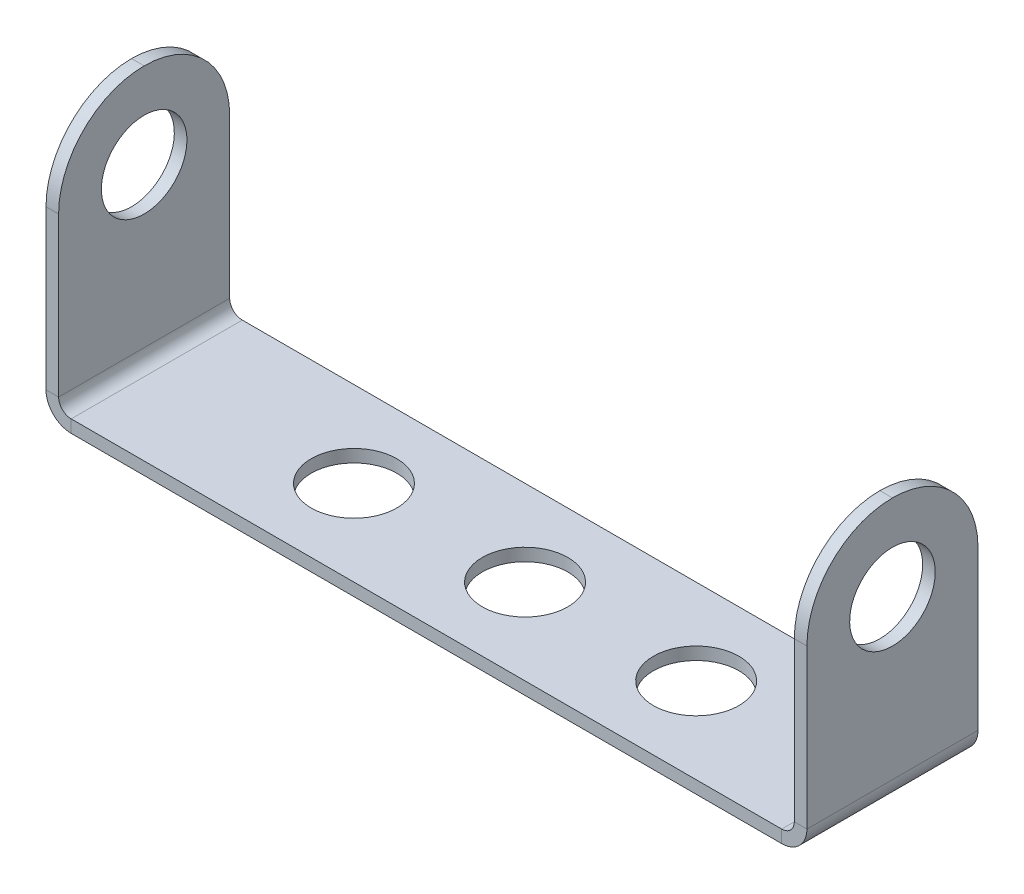
ISO-10303-21;
HEADER;
FILE_DESCRIPTION(('STEP AP214'),'2;1');
FILE_NAME('part.step','',(''),(''),'','','');
FILE_SCHEMA(('AUTOMOTIVE_DESIGN { 1 0 10303 214 1 1 1 1 }'));
ENDSEC;
DATA;
#1=APPLICATION_CONTEXT('core data for automotive mechanical design processes');
#2=APPLICATION_PROTOCOL_DEFINITION('international standard','automotive_design',2000,#1);
#3=PRODUCT_CONTEXT('',#1,'mechanical');
#4=PRODUCT('Part','Part','',(#3));
#5=PRODUCT_RELATED_PRODUCT_CATEGORY('part','',(#4));
#6=PRODUCT_DEFINITION_FORMATION('','',#4);
#7=PRODUCT_DEFINITION_CONTEXT('part definition',#1,'design');
#8=PRODUCT_DEFINITION('design','',#6,#7);
#9=PRODUCT_DEFINITION_SHAPE('','',#8);
#10=(LENGTH_UNIT() NAMED_UNIT(*) SI_UNIT(.MILLI.,.METRE.));
#11=(NAMED_UNIT(*) PLANE_ANGLE_UNIT() SI_UNIT($,.RADIAN.));
#12=(NAMED_UNIT(*) SI_UNIT($,.STERADIAN.) SOLID_ANGLE_UNIT());
#13=UNCERTAINTY_MEASURE_WITH_UNIT(LENGTH_MEASURE(1.E-05),#10,'distance_accuracy_value','');
#14=(GEOMETRIC_REPRESENTATION_CONTEXT(3) GLOBAL_UNCERTAINTY_ASSIGNED_CONTEXT((#13)) GLOBAL_UNIT_ASSIGNED_CONTEXT((#10,
#11,#12)) REPRESENTATION_CONTEXT('',''));
#15=CARTESIAN_POINT('',(0.,0.,0.));
#16=DIRECTION('',(0.,0.,1.));
#17=DIRECTION('',(1.,0.,0.));
#18=AXIS2_PLACEMENT_3D('',#15,#16,#17);
#19=CARTESIAN_POINT('',(-20.7634,0.,10.));
#20=DIRECTION('',(0.,0.,1.));
#21=DIRECTION('',(1.,0.,0.));
#22=AXIS2_PLACEMENT_3D('',#19,#20,#21);
#23=PLANE('',#22);
#24=DIRECTION('',(0.,-1.,0.));
#25=VECTOR('',#24,1.);
#26=CARTESIAN_POINT('',(-20.7634,0.,10.));
#27=LINE('',#26,#25);
#28=CARTESIAN_POINT('',(-20.7634,0.,10.));
#29=VERTEX_POINT('',#28);
#30=CARTESIAN_POINT('',(-20.7634,-0.7366,10.));
#31=VERTEX_POINT('',#30);
#32=EDGE_CURVE('E249',#29,#31,#27,.T.);
#33=ORIENTED_EDGE('',*,*,#32,.F.);
#34=CARTESIAN_POINT('',(-20.7634,0.7366,10.));
#35=DIRECTION('',(0.,0.,-1.));
#36=DIRECTION('',(-1.,0.,0.));
#37=AXIS2_PLACEMENT_3D('',#34,#35,#36);
#38=CIRCLE('',#37,0.7366);
#39=CARTESIAN_POINT('',(-21.5,0.7366,10.));
#40=VERTEX_POINT('',#39);
#41=EDGE_CURVE('E176',#40,#29,#38,.F.);
#42=ORIENTED_EDGE('',*,*,#41,.F.);
#43=DIRECTION('',(1.,0.,0.));
#44=VECTOR('',#43,1.);
#45=CARTESIAN_POINT('',(-22.2366,0.7366,10.));
#46=LINE('',#45,#44);
#47=CARTESIAN_POINT('',(-22.2366,0.7366,10.));
#48=VERTEX_POINT('',#47);
#49=EDGE_CURVE('E246',#48,#40,#46,.T.);
#50=ORIENTED_EDGE('',*,*,#49,.F.);
#51=CARTESIAN_POINT('',(-20.7634,0.7366,10.));
#52=DIRECTION('',(0.,0.,1.));
#53=DIRECTION('',(1.,0.,0.));
#54=AXIS2_PLACEMENT_3D('',#51,#52,#53);
#55=CIRCLE('',#54,1.4732);
#56=EDGE_CURVE('E186',#48,#31,#55,.T.);
#57=ORIENTED_EDGE('',*,*,#56,.T.);
#58=EDGE_LOOP('',(#33,#42,#50,#57));
#59=FACE_BOUND('',#58,.T.);
#60=ADVANCED_FACE('F39',(#59),#23,.T.);
#61=CARTESIAN_POINT('',(-22.2366,0.7366,10.));
#62=DIRECTION('',(0.,0.,1.));
#63=DIRECTION('',(1.,0.,0.));
#64=AXIS2_PLACEMENT_3D('',#61,#62,#63);
#65=PLANE('',#64);
#66=DIRECTION('',(1.,0.,0.));
#67=VECTOR('',#66,1.);
#68=CARTESIAN_POINT('',(-21.5,0.,10.));
#69=LINE('',#68,#67);
#70=CARTESIAN_POINT('',(20.7634,0.,10.));
#71=VERTEX_POINT('',#70);
#72=EDGE_CURVE('E174',#29,#71,#69,.T.);
#73=ORIENTED_EDGE('',*,*,#72,.F.);
#74=ORIENTED_EDGE('',*,*,#32,.T.);
#75=DIRECTION('',(1.,0.,0.));
#76=VECTOR('',#75,1.);
#77=CARTESIAN_POINT('',(-21.5,-0.7366,10.));
#78=LINE('',#77,#76);
#79=CARTESIAN_POINT('',(20.7634,-0.736599999999992,10.));
#80=VERTEX_POINT('',#79);
#81=EDGE_CURVE('E189',#31,#80,#78,.T.);
#82=ORIENTED_EDGE('',*,*,#81,.T.);
#83=DIRECTION('',(0.,1.,0.));
#84=VECTOR('',#83,1.);
#85=CARTESIAN_POINT('',(20.7634,-0.736599999999992,10.));
#86=LINE('',#85,#84);
#87=EDGE_CURVE('E152',#80,#71,#86,.T.);
#88=ORIENTED_EDGE('',*,*,#87,.T.);
#89=EDGE_LOOP('',(#73,#74,#82,#88));
#90=FACE_BOUND('',#89,.T.);
#91=ADVANCED_FACE('F329',(#90),#65,.T.);
#92=CARTESIAN_POINT('',(-21.5,0.7366,0.));
#93=DIRECTION('',(0.,0.,-1.));
#94=DIRECTION('',(-1.,0.,0.));
#95=AXIS2_PLACEMENT_3D('',#92,#93,#94);
#96=PLANE('',#95);
#97=DIRECTION('',(-1.,0.,0.));
#98=VECTOR('',#97,1.);
#99=CARTESIAN_POINT('',(-21.5,0.7366,0.));
#100=LINE('',#99,#98);
#101=CARTESIAN_POINT('',(-21.5,0.7366,0.));
#102=VERTEX_POINT('',#101);
#103=CARTESIAN_POINT('',(-22.2366,0.7366,0.));
#104=VERTEX_POINT('',#103);
#105=EDGE_CURVE('E243',#102,#104,#100,.T.);
#106=ORIENTED_EDGE('',*,*,#105,.F.);
#107=CARTESIAN_POINT('',(-20.7634,0.7366,0.));
#108=DIRECTION('',(0.,0.,-1.));
#109=DIRECTION('',(-1.,0.,0.));
#110=AXIS2_PLACEMENT_3D('',#107,#108,#109);
#111=CIRCLE('',#110,0.7366);
#112=CARTESIAN_POINT('',(-20.7634,0.,0.));
#113=VERTEX_POINT('',#112);
#114=EDGE_CURVE('E204',#102,#113,#111,.F.);
#115=ORIENTED_EDGE('',*,*,#114,.T.);
#116=DIRECTION('',(0.,1.,0.));
#117=VECTOR('',#116,1.);
#118=CARTESIAN_POINT('',(-20.7634,-0.7366,0.));
#119=LINE('',#118,#117);
#120=CARTESIAN_POINT('',(-20.7634,-0.7366,0.));
#121=VERTEX_POINT('',#120);
#122=EDGE_CURVE('E151',#121,#113,#119,.T.);
#123=ORIENTED_EDGE('',*,*,#122,.F.);
#124=CARTESIAN_POINT('',(-20.7634,0.7366,0.));
#125=DIRECTION('',(0.,0.,1.));
#126=DIRECTION('',(1.,0.,0.));
#127=AXIS2_PLACEMENT_3D('',#124,#125,#126);
#128=CIRCLE('',#127,1.4732);
#129=EDGE_CURVE('E211',#104,#121,#128,.T.);
#130=ORIENTED_EDGE('',*,*,#129,.F.);
#131=EDGE_LOOP('',(#106,#115,#123,#130));
#132=FACE_BOUND('',#131,.T.);
#133=ADVANCED_FACE('F344',(#132),#96,.T.);
#134=CARTESIAN_POINT('',(-20.7634,-0.7366,0.));
#135=DIRECTION('',(0.,0.,-1.));
#136=DIRECTION('',(-1.,0.,0.));
#137=AXIS2_PLACEMENT_3D('',#134,#135,#136);
#138=PLANE('',#137);
#139=DIRECTION('',(0.,-1.,0.));
#140=VECTOR('',#139,1.);
#141=CARTESIAN_POINT('',(-22.2366,15.,0.));
#142=LINE('',#141,#140);
#143=CARTESIAN_POINT('',(-22.2366,10.,0.));
#144=VERTEX_POINT('',#143);
#145=EDGE_CURVE('E209',#144,#104,#142,.T.);
#146=ORIENTED_EDGE('',*,*,#145,.F.);
#147=DIRECTION('',(1.,0.,0.));
#148=VECTOR('',#147,1.);
#149=CARTESIAN_POINT('',(-20.7634,10.,0.));
#150=LINE('',#149,#148);
#151=CARTESIAN_POINT('',(-21.5,10.,0.));
#152=VERTEX_POINT('',#151);
#153=EDGE_CURVE('E251',#144,#152,#150,.T.);
#154=ORIENTED_EDGE('',*,*,#153,.T.);
#155=DIRECTION('',(0.,-1.,0.));
#156=VECTOR('',#155,1.);
#157=CARTESIAN_POINT('',(-21.5,15.,0.));
#158=LINE('',#157,#156);
#159=EDGE_CURVE('E207',#152,#102,#158,.T.);
#160=ORIENTED_EDGE('',*,*,#159,.T.);
#161=ORIENTED_EDGE('',*,*,#105,.T.);
#162=EDGE_LOOP('',(#146,#154,#160,#161));
#163=FACE_BOUND('',#162,.T.);
#164=ADVANCED_FACE('F363',(#163),#138,.T.);
#165=CARTESIAN_POINT('',(21.5,0.736600000000008,10.));
#166=DIRECTION('',(0.,0.,1.));
#167=DIRECTION('',(1.,0.,0.));
#168=AXIS2_PLACEMENT_3D('',#165,#166,#167);
#169=PLANE('',#168);
#170=DIRECTION('',(1.,0.,0.));
#171=VECTOR('',#170,1.);
#172=CARTESIAN_POINT('',(21.5,0.736600000000008,10.));
#173=LINE('',#172,#171);
#174=CARTESIAN_POINT('',(21.5,0.736600000000008,10.));
#175=VERTEX_POINT('',#174);
#176=CARTESIAN_POINT('',(22.2366,0.736600000000008,10.));
#177=VERTEX_POINT('',#176);
#178=EDGE_CURVE('E139',#175,#177,#173,.T.);
#179=ORIENTED_EDGE('',*,*,#178,.F.);
#180=CARTESIAN_POINT('',(20.7634,0.736600000000008,10.));
#181=DIRECTION('',(0.,0.,-1.));
#182=DIRECTION('',(-1.,0.,0.));
#183=AXIS2_PLACEMENT_3D('',#180,#181,#182);
#184=CIRCLE('',#183,0.7366);
#185=EDGE_CURVE('E143',#71,#175,#184,.F.);
#186=ORIENTED_EDGE('',*,*,#185,.F.);
#187=ORIENTED_EDGE('',*,*,#87,.F.);
#188=CARTESIAN_POINT('',(20.7634,0.736600000000008,10.));
#189=DIRECTION('',(0.,0.,1.));
#190=DIRECTION('',(1.,0.,0.));
#191=AXIS2_PLACEMENT_3D('',#188,#189,#190);
#192=CIRCLE('',#191,1.4732);
#193=EDGE_CURVE('E146',#80,#177,#192,.T.);
#194=ORIENTED_EDGE('',*,*,#193,.T.);
#195=EDGE_LOOP('',(#179,#186,#187,#194));
#196=FACE_BOUND('',#195,.T.);
#197=ADVANCED_FACE('F141',(#196),#169,.T.);
#198=CARTESIAN_POINT('',(20.7634,-0.736599999999992,10.));
#199=DIRECTION('',(0.,0.,1.));
#200=DIRECTION('',(1.,0.,0.));
#201=AXIS2_PLACEMENT_3D('',#198,#199,#200);
#202=PLANE('',#201);
#203=DIRECTION('',(0.,1.,0.));
#204=VECTOR('',#203,1.);
#205=CARTESIAN_POINT('',(22.2366,0.,10.));
#206=LINE('',#205,#204);
#207=CARTESIAN_POINT('',(22.2366,10.,10.));
#208=VERTEX_POINT('',#207);
#209=EDGE_CURVE('E169',#177,#208,#206,.T.);
#210=ORIENTED_EDGE('',*,*,#209,.T.);
#211=DIRECTION('',(1.,0.,0.));
#212=VECTOR('',#211,1.);
#213=CARTESIAN_POINT('',(20.7634,10.,10.));
#214=LINE('',#213,#212);
#215=CARTESIAN_POINT('',(21.5,10.,10.));
#216=VERTEX_POINT('',#215);
#217=EDGE_CURVE('E168',#208,#216,#214,.F.);
#218=ORIENTED_EDGE('',*,*,#217,.T.);
#219=DIRECTION('',(0.,1.,0.));
#220=VECTOR('',#219,1.);
#221=CARTESIAN_POINT('',(21.5,0.,10.));
#222=LINE('',#221,#220);
#223=EDGE_CURVE('E157',#175,#216,#222,.T.);
#224=ORIENTED_EDGE('',*,*,#223,.F.);
#225=ORIENTED_EDGE('',*,*,#178,.T.);
#226=EDGE_LOOP('',(#210,#218,#224,#225));
#227=FACE_BOUND('',#226,.T.);
#228=ADVANCED_FACE('F166',(#227),#202,.T.);
#229=CARTESIAN_POINT('',(20.7634,0.,0.));
#230=DIRECTION('',(0.,0.,-1.));
#231=DIRECTION('',(-1.,0.,0.));
#232=AXIS2_PLACEMENT_3D('',#229,#230,#231);
#233=PLANE('',#232);
#234=DIRECTION('',(0.,-1.,0.));
#235=VECTOR('',#234,1.);
#236=CARTESIAN_POINT('',(20.7634,0.,0.));
#237=LINE('',#236,#235);
#238=CARTESIAN_POINT('',(20.7634,0.,0.));
#239=VERTEX_POINT('',#238);
#240=CARTESIAN_POINT('',(20.7634,-0.736599999999992,0.));
#241=VERTEX_POINT('',#240);
#242=EDGE_CURVE('E239',#239,#241,#237,.T.);
#243=ORIENTED_EDGE('',*,*,#242,.F.);
#244=CARTESIAN_POINT('',(20.7634,0.736600000000008,0.));
#245=DIRECTION('',(0.,0.,-1.));
#246=DIRECTION('',(-1.,0.,0.));
#247=AXIS2_PLACEMENT_3D('',#244,#245,#246);
#248=CIRCLE('',#247,0.7366);
#249=CARTESIAN_POINT('',(21.5,0.736600000000008,0.));
#250=VERTEX_POINT('',#249);
#251=EDGE_CURVE('E199',#239,#250,#248,.F.);
#252=ORIENTED_EDGE('',*,*,#251,.T.);
#253=DIRECTION('',(-1.,0.,0.));
#254=VECTOR('',#253,1.);
#255=CARTESIAN_POINT('',(22.2366,0.736600000000008,0.));
#256=LINE('',#255,#254);
#257=CARTESIAN_POINT('',(22.2366,0.736600000000008,0.));
#258=VERTEX_POINT('',#257);
#259=EDGE_CURVE('E162',#258,#250,#256,.T.);
#260=ORIENTED_EDGE('',*,*,#259,.F.);
#261=CARTESIAN_POINT('',(20.7634,0.736600000000008,0.));
#262=DIRECTION('',(0.,0.,1.));
#263=DIRECTION('',(1.,0.,0.));
#264=AXIS2_PLACEMENT_3D('',#261,#262,#263);
#265=CIRCLE('',#264,1.4732);
#266=EDGE_CURVE('E217',#241,#258,#265,.T.);
#267=ORIENTED_EDGE('',*,*,#266,.F.);
#268=EDGE_LOOP('',(#243,#252,#260,#267));
#269=FACE_BOUND('',#268,.T.);
#270=ADVANCED_FACE('F312',(#269),#233,.T.);
#271=CARTESIAN_POINT('',(22.2366,0.736600000000008,0.));
#272=DIRECTION('',(0.,0.,-1.));
#273=DIRECTION('',(-1.,0.,0.));
#274=AXIS2_PLACEMENT_3D('',#271,#272,#273);
#275=PLANE('',#274);
#276=DIRECTION('',(1.,0.,0.));
#277=VECTOR('',#276,1.);
#278=CARTESIAN_POINT('',(-21.5,0.,0.));
#279=LINE('',#278,#277);
#280=EDGE_CURVE('E201',#113,#239,#279,.T.);
#281=ORIENTED_EDGE('',*,*,#280,.T.);
#282=ORIENTED_EDGE('',*,*,#242,.T.);
#283=DIRECTION('',(1.,0.,0.));
#284=VECTOR('',#283,1.);
#285=CARTESIAN_POINT('',(-21.5,-0.7366,0.));
#286=LINE('',#285,#284);
#287=EDGE_CURVE('E214',#121,#241,#286,.T.);
#288=ORIENTED_EDGE('',*,*,#287,.F.);
#289=ORIENTED_EDGE('',*,*,#122,.T.);
#290=EDGE_LOOP('',(#281,#282,#288,#289));
#291=FACE_BOUND('',#290,.T.);
#292=ADVANCED_FACE('F322',(#291),#275,.T.);
#293=CARTESIAN_POINT('',(22.2366,0.,10.));
#294=DIRECTION('',(-1.,0.,0.));
#295=DIRECTION('',(0.,-1.,0.));
#296=AXIS2_PLACEMENT_3D('',#293,#294,#295);
#297=PLANE('',#296);
#298=CARTESIAN_POINT('',(22.2366,10.,5.));
#299=DIRECTION('',(1.,0.,0.));
#300=DIRECTION('',(0.,1.,0.));
#301=AXIS2_PLACEMENT_3D('',#298,#299,#300);
#302=CIRCLE('',#301,2.5);
#303=CARTESIAN_POINT('',(22.2366,12.5,5.));
#304=VERTEX_POINT('',#303);
#305=EDGE_CURVE('E272',#304,#304,#302,.T.);
#306=ORIENTED_EDGE('',*,*,#305,.F.);
#307=EDGE_LOOP('',(#306));
#308=FACE_BOUND('',#307,.T.);
#309=CARTESIAN_POINT('',(22.2366,10.,5.));
#310=DIRECTION('',(-1.,0.,0.));
#311=DIRECTION('',(0.,-1.,0.));
#312=AXIS2_PLACEMENT_3D('',#309,#310,#311);
#313=CIRCLE('',#312,5.);
#314=CARTESIAN_POINT('',(22.2366,10.,0.));
#315=VERTEX_POINT('',#314);
#316=CARTESIAN_POINT('',(22.2366,15.,5.));
#317=VERTEX_POINT('',#316);
#318=EDGE_CURVE('E264',#315,#317,#313,.F.);
#319=ORIENTED_EDGE('',*,*,#318,.T.);
#320=CARTESIAN_POINT('',(22.2366,10.,5.));
#321=DIRECTION('',(-1.,0.,0.));
#322=DIRECTION('',(0.,-1.,0.));
#323=AXIS2_PLACEMENT_3D('',#320,#321,#322);
#324=CIRCLE('',#323,5.);
#325=EDGE_CURVE('E266',#317,#208,#324,.F.);
#326=ORIENTED_EDGE('',*,*,#325,.T.);
#327=ORIENTED_EDGE('',*,*,#209,.F.);
#328=DIRECTION('',(0.,0.,-1.));
#329=VECTOR('',#328,1.);
#330=CARTESIAN_POINT('',(22.2366,0.736600000000008,10.));
#331=LINE('',#330,#329);
#332=EDGE_CURVE('E193',#177,#258,#331,.T.);
#333=ORIENTED_EDGE('',*,*,#332,.T.);
#334=DIRECTION('',(0.,1.,0.));
#335=VECTOR('',#334,1.);
#336=CARTESIAN_POINT('',(22.2366,0.,0.));
#337=LINE('',#336,#335);
#338=EDGE_CURVE('E194',#258,#315,#337,.T.);
#339=ORIENTED_EDGE('',*,*,#338,.T.);
#340=EDGE_LOOP('',(#319,#326,#327,#333,#339));
#341=FACE_BOUND('',#340,.T.);
#342=ADVANCED_FACE('F303',(#308,#341),#297,.F.);
#343=CARTESIAN_POINT('',(21.5,0.,10.));
#344=DIRECTION('',(-1.,0.,0.));
#345=DIRECTION('',(0.,-1.,0.));
#346=AXIS2_PLACEMENT_3D('',#343,#344,#345);
#347=PLANE('',#346);
#348=CARTESIAN_POINT('',(21.5,10.,5.));
#349=DIRECTION('',(-1.,0.,0.));
#350=DIRECTION('',(0.,-1.,0.));
#351=AXIS2_PLACEMENT_3D('',#348,#349,#350);
#352=CIRCLE('',#351,2.5);
#353=CARTESIAN_POINT('',(21.5,7.50000000000001,5.));
#354=VERTEX_POINT('',#353);
#355=EDGE_CURVE('E197',#354,#354,#352,.T.);
#356=ORIENTED_EDGE('',*,*,#355,.F.);
#357=EDGE_LOOP('',(#356));
#358=FACE_BOUND('',#357,.T.);
#359=ORIENTED_EDGE('',*,*,#223,.T.);
#360=CARTESIAN_POINT('',(21.5,10.,5.));
#361=DIRECTION('',(-1.,0.,0.));
#362=DIRECTION('',(0.,-1.,0.));
#363=AXIS2_PLACEMENT_3D('',#360,#361,#362);
#364=CIRCLE('',#363,5.);
#365=CARTESIAN_POINT('',(21.5,15.,5.));
#366=VERTEX_POINT('',#365);
#367=EDGE_CURVE('E48',#216,#366,#364,.T.);
#368=ORIENTED_EDGE('',*,*,#367,.T.);
#369=CARTESIAN_POINT('',(21.5,10.,5.));
#370=DIRECTION('',(-1.,0.,0.));
#371=DIRECTION('',(0.,-1.,0.));
#372=AXIS2_PLACEMENT_3D('',#369,#370,#371);
#373=CIRCLE('',#372,5.);
#374=CARTESIAN_POINT('',(21.5,10.,0.));
#375=VERTEX_POINT('',#374);
#376=EDGE_CURVE('E59',#366,#375,#373,.T.);
#377=ORIENTED_EDGE('',*,*,#376,.T.);
#378=DIRECTION('',(0.,1.,0.));
#379=VECTOR('',#378,1.);
#380=CARTESIAN_POINT('',(21.5,0.,0.));
#381=LINE('',#380,#379);
#382=EDGE_CURVE('E158',#250,#375,#381,.T.);
#383=ORIENTED_EDGE('',*,*,#382,.F.);
#384=DIRECTION('',(0.,0.,-1.));
#385=VECTOR('',#384,1.);
#386=CARTESIAN_POINT('',(21.5,0.736600000000008,10.));
#387=LINE('',#386,#385);
#388=EDGE_CURVE('E155',#175,#250,#387,.T.);
#389=ORIENTED_EDGE('',*,*,#388,.F.);
#390=EDGE_LOOP('',(#359,#368,#377,#383,#389));
#391=FACE_BOUND('',#390,.T.);
#392=ADVANCED_FACE('F156',(#358,#391),#347,.T.);
#393=CARTESIAN_POINT('',(20.7634,0.736600000000008,10.));
#394=DIRECTION('',(0.,0.,-1.));
#395=DIRECTION('',(-1.,0.,0.));
#396=AXIS2_PLACEMENT_3D('',#393,#394,#395);
#397=CYLINDRICAL_SURFACE('',#396,0.7366);
#398=ORIENTED_EDGE('',*,*,#251,.F.);
#399=DIRECTION('',(0.,0.,-1.));
#400=VECTOR('',#399,1.);
#401=CARTESIAN_POINT('',(20.7634,0.,10.));
#402=LINE('',#401,#400);
#403=EDGE_CURVE('E163',#71,#239,#402,.T.);
#404=ORIENTED_EDGE('',*,*,#403,.F.);
#405=ORIENTED_EDGE('',*,*,#185,.T.);
#406=ORIENTED_EDGE('',*,*,#388,.T.);
#407=EDGE_LOOP('',(#398,#404,#405,#406));
#408=FACE_BOUND('',#407,.T.);
#409=ADVANCED_FACE('F172',(#408),#397,.F.);
#410=CARTESIAN_POINT('',(-21.5,0.,10.));
#411=DIRECTION('',(0.,1.,0.));
#412=DIRECTION('',(-1.,0.,0.));
#413=AXIS2_PLACEMENT_3D('',#410,#411,#412);
#414=PLANE('',#413);
#415=CARTESIAN_POINT('',(-9.23660000000001,0.,5.00000000000014));
#416=DIRECTION('',(0.,1.,0.));
#417=DIRECTION('',(-1.,0.,0.));
#418=AXIS2_PLACEMENT_3D('',#415,#416,#417);
#419=CIRCLE('',#418,2.5);
#420=CARTESIAN_POINT('',(-11.7366,0.,5.00000000000014));
#421=VERTEX_POINT('',#420);
#422=EDGE_CURVE('E590',#421,#421,#419,.T.);
#423=ORIENTED_EDGE('',*,*,#422,.F.);
#424=EDGE_LOOP('',(#423));
#425=FACE_BOUND('',#424,.T.);
#426=CARTESIAN_POINT('',(0.763399999999994,0.,5.00000000000007));
#427=DIRECTION('',(0.,1.,0.));
#428=DIRECTION('',(-1.,0.,0.));
#429=AXIS2_PLACEMENT_3D('',#426,#427,#428);
#430=CIRCLE('',#429,2.5);
#431=CARTESIAN_POINT('',(-1.7366,0.,5.00000000000007));
#432=VERTEX_POINT('',#431);
#433=EDGE_CURVE('E594',#432,#432,#430,.T.);
#434=ORIENTED_EDGE('',*,*,#433,.F.);
#435=EDGE_LOOP('',(#434));
#436=FACE_BOUND('',#435,.T.);
#437=CARTESIAN_POINT('',(10.7634,0.,5.));
#438=DIRECTION('',(0.,1.,0.));
#439=DIRECTION('',(-1.,0.,0.));
#440=AXIS2_PLACEMENT_3D('',#437,#438,#439);
#441=CIRCLE('',#440,2.5);
#442=CARTESIAN_POINT('',(8.2634,0.,5.));
#443=VERTEX_POINT('',#442);
#444=EDGE_CURVE('E285',#443,#443,#441,.T.);
#445=ORIENTED_EDGE('',*,*,#444,.F.);
#446=EDGE_LOOP('',(#445));
#447=FACE_BOUND('',#446,.T.);
#448=ORIENTED_EDGE('',*,*,#280,.F.);
#449=DIRECTION('',(0.,0.,-1.));
#450=VECTOR('',#449,1.);
#451=CARTESIAN_POINT('',(-20.7634,0.,10.));
#452=LINE('',#451,#450);
#453=EDGE_CURVE('E234',#29,#113,#452,.T.);
#454=ORIENTED_EDGE('',*,*,#453,.F.);
#455=ORIENTED_EDGE('',*,*,#72,.T.);
#456=ORIENTED_EDGE('',*,*,#403,.T.);
#457=EDGE_LOOP('',(#448,#454,#455,#456));
#458=FACE_BOUND('',#457,.T.);
#459=ADVANCED_FACE('F325',(#425,#436,#447,#458),#414,.T.);
#460=CARTESIAN_POINT('',(-20.7634,0.7366,10.));
#461=DIRECTION('',(0.,0.,-1.));
#462=DIRECTION('',(-1.,0.,0.));
#463=AXIS2_PLACEMENT_3D('',#460,#461,#462);
#464=CYLINDRICAL_SURFACE('',#463,0.7366);
#465=ORIENTED_EDGE('',*,*,#114,.F.);
#466=DIRECTION('',(0.,0.,-1.));
#467=VECTOR('',#466,1.);
#468=CARTESIAN_POINT('',(-21.5,0.7366,10.));
#469=LINE('',#468,#467);
#470=EDGE_CURVE('E231',#40,#102,#469,.T.);
#471=ORIENTED_EDGE('',*,*,#470,.F.);
#472=ORIENTED_EDGE('',*,*,#41,.T.);
#473=ORIENTED_EDGE('',*,*,#453,.T.);
#474=EDGE_LOOP('',(#465,#471,#472,#473));
#475=FACE_BOUND('',#474,.T.);
#476=ADVANCED_FACE('F334',(#475),#464,.F.);
#477=CARTESIAN_POINT('',(-21.5,15.,10.));
#478=DIRECTION('',(1.,0.,0.));
#479=DIRECTION('',(0.,1.,0.));
#480=AXIS2_PLACEMENT_3D('',#477,#478,#479);
#481=PLANE('',#480);
#482=CARTESIAN_POINT('',(-21.5,10.,5.));
#483=DIRECTION('',(1.,0.,0.));
#484=DIRECTION('',(0.,1.,0.));
#485=AXIS2_PLACEMENT_3D('',#482,#483,#484);
#486=CIRCLE('',#485,2.5);
#487=CARTESIAN_POINT('',(-21.5,12.5,5.));
#488=VERTEX_POINT('',#487);
#489=EDGE_CURVE('E295',#488,#488,#486,.T.);
#490=ORIENTED_EDGE('',*,*,#489,.F.);
#491=EDGE_LOOP('',(#490));
#492=FACE_BOUND('',#491,.T.);
#493=ORIENTED_EDGE('',*,*,#159,.F.);
#494=CARTESIAN_POINT('',(-21.5,10.,5.));
#495=DIRECTION('',(1.,0.,0.));
#496=DIRECTION('',(0.,1.,0.));
#497=AXIS2_PLACEMENT_3D('',#494,#495,#496);
#498=CIRCLE('',#497,5.);
#499=CARTESIAN_POINT('',(-21.5,15.,5.));
#500=VERTEX_POINT('',#499);
#501=EDGE_CURVE('E256',#152,#500,#498,.T.);
#502=ORIENTED_EDGE('',*,*,#501,.T.);
#503=CARTESIAN_POINT('',(-21.5,10.,5.));
#504=DIRECTION('',(1.,0.,0.));
#505=DIRECTION('',(0.,1.,0.));
#506=AXIS2_PLACEMENT_3D('',#503,#504,#505);
#507=CIRCLE('',#506,5.);
#508=CARTESIAN_POINT('',(-21.5,10.,10.));
#509=VERTEX_POINT('',#508);
#510=EDGE_CURVE('E254',#500,#509,#507,.T.);
#511=ORIENTED_EDGE('',*,*,#510,.T.);
#512=DIRECTION('',(0.,-1.,0.));
#513=VECTOR('',#512,1.);
#514=CARTESIAN_POINT('',(-21.5,15.,10.));
#515=LINE('',#514,#513);
#516=EDGE_CURVE('E182',#509,#40,#515,.T.);
#517=ORIENTED_EDGE('',*,*,#516,.T.);
#518=ORIENTED_EDGE('',*,*,#470,.T.);
#519=EDGE_LOOP('',(#493,#502,#511,#517,#518));
#520=FACE_BOUND('',#519,.T.);
#521=ADVANCED_FACE('F349',(#492,#520),#481,.T.);
#522=CARTESIAN_POINT('',(-22.2366,15.,10.));
#523=DIRECTION('',(1.,0.,0.));
#524=DIRECTION('',(0.,1.,0.));
#525=AXIS2_PLACEMENT_3D('',#522,#523,#524);
#526=PLANE('',#525);
#527=CARTESIAN_POINT('',(-22.2366,10.,5.));
#528=DIRECTION('',(1.,0.,0.));
#529=DIRECTION('',(0.,1.,0.));
#530=AXIS2_PLACEMENT_3D('',#527,#528,#529);
#531=CIRCLE('',#530,2.5);
#532=CARTESIAN_POINT('',(-22.2366,12.5,5.));
#533=VERTEX_POINT('',#532);
#534=EDGE_CURVE('E277',#533,#533,#531,.T.);
#535=ORIENTED_EDGE('',*,*,#534,.T.);
#536=EDGE_LOOP('',(#535));
#537=FACE_BOUND('',#536,.T.);
#538=CARTESIAN_POINT('',(-22.2366,10.,5.));
#539=DIRECTION('',(1.,0.,0.));
#540=DIRECTION('',(0.,1.,0.));
#541=AXIS2_PLACEMENT_3D('',#538,#539,#540);
#542=CIRCLE('',#541,5.);
#543=CARTESIAN_POINT('',(-22.2366,10.,10.));
#544=VERTEX_POINT('',#543);
#545=CARTESIAN_POINT('',(-22.2366,15.,5.));
#546=VERTEX_POINT('',#545);
#547=EDGE_CURVE('E258',#544,#546,#542,.F.);
#548=ORIENTED_EDGE('',*,*,#547,.T.);
#549=CARTESIAN_POINT('',(-22.2366,10.,5.));
#550=DIRECTION('',(1.,0.,0.));
#551=DIRECTION('',(0.,1.,0.));
#552=AXIS2_PLACEMENT_3D('',#549,#550,#551);
#553=CIRCLE('',#552,5.);
#554=EDGE_CURVE('E260',#546,#144,#553,.F.);
#555=ORIENTED_EDGE('',*,*,#554,.T.);
#556=ORIENTED_EDGE('',*,*,#145,.T.);
#557=DIRECTION('',(0.,0.,-1.));
#558=VECTOR('',#557,1.);
#559=CARTESIAN_POINT('',(-22.2366,0.7366,10.));
#560=LINE('',#559,#558);
#561=EDGE_CURVE('E228',#48,#104,#560,.T.);
#562=ORIENTED_EDGE('',*,*,#561,.F.);
#563=DIRECTION('',(0.,-1.,0.));
#564=VECTOR('',#563,1.);
#565=CARTESIAN_POINT('',(-22.2366,15.,10.));
#566=LINE('',#565,#564);
#567=EDGE_CURVE('E184',#544,#48,#566,.T.);
#568=ORIENTED_EDGE('',*,*,#567,.F.);
#569=EDGE_LOOP('',(#548,#555,#556,#562,#568));
#570=FACE_BOUND('',#569,.T.);
#571=ADVANCED_FACE('F358',(#537,#570),#526,.F.);
#572=CARTESIAN_POINT('',(-20.7634,0.7366,10.));
#573=DIRECTION('',(0.,0.,-1.));
#574=DIRECTION('',(-1.,0.,0.));
#575=AXIS2_PLACEMENT_3D('',#572,#573,#574);
#576=CYLINDRICAL_SURFACE('',#575,1.4732);
#577=ORIENTED_EDGE('',*,*,#129,.T.);
#578=DIRECTION('',(0.,0.,-1.));
#579=VECTOR('',#578,1.);
#580=CARTESIAN_POINT('',(-20.7634,-0.7366,10.));
#581=LINE('',#580,#579);
#582=EDGE_CURVE('E225',#31,#121,#581,.T.);
#583=ORIENTED_EDGE('',*,*,#582,.F.);
#584=ORIENTED_EDGE('',*,*,#56,.F.);
#585=ORIENTED_EDGE('',*,*,#561,.T.);
#586=EDGE_LOOP('',(#577,#583,#584,#585));
#587=FACE_BOUND('',#586,.T.);
#588=ADVANCED_FACE('F340',(#587),#576,.T.);
#589=CARTESIAN_POINT('',(-21.5,-0.7366,10.));
#590=DIRECTION('',(0.,1.,0.));
#591=DIRECTION('',(-1.,0.,0.));
#592=AXIS2_PLACEMENT_3D('',#589,#590,#591);
#593=PLANE('',#592);
#594=CARTESIAN_POINT('',(-9.23660000000001,-0.736599999999998,5.00000000000014));
#595=DIRECTION('',(0.,1.,0.));
#596=DIRECTION('',(-1.,0.,0.));
#597=AXIS2_PLACEMENT_3D('',#594,#595,#596);
#598=CIRCLE('',#597,2.5);
#599=CARTESIAN_POINT('',(-11.7366,-0.736599999999998,5.00000000000014));
#600=VERTEX_POINT('',#599);
#601=EDGE_CURVE('E593',#600,#600,#598,.F.);
#602=ORIENTED_EDGE('',*,*,#601,.F.);
#603=EDGE_LOOP('',(#602));
#604=FACE_BOUND('',#603,.T.);
#605=CARTESIAN_POINT('',(0.763399999999994,-0.736599999999996,5.00000000000007));
#606=DIRECTION('',(0.,1.,0.));
#607=DIRECTION('',(-1.,0.,0.));
#608=AXIS2_PLACEMENT_3D('',#605,#606,#607);
#609=CIRCLE('',#608,2.5);
#610=CARTESIAN_POINT('',(-1.7366,-0.736599999999996,5.00000000000007));
#611=VERTEX_POINT('',#610);
#612=EDGE_CURVE('E290',#611,#611,#609,.F.);
#613=ORIENTED_EDGE('',*,*,#612,.F.);
#614=EDGE_LOOP('',(#613));
#615=FACE_BOUND('',#614,.T.);
#616=CARTESIAN_POINT('',(10.7634,-0.736599999999994,5.));
#617=DIRECTION('',(0.,1.,0.));
#618=DIRECTION('',(-1.,0.,0.));
#619=AXIS2_PLACEMENT_3D('',#616,#617,#618);
#620=CIRCLE('',#619,2.5);
#621=CARTESIAN_POINT('',(8.2634,-0.736599999999994,5.));
#622=VERTEX_POINT('',#621);
#623=EDGE_CURVE('E280',#622,#622,#620,.F.);
#624=ORIENTED_EDGE('',*,*,#623,.F.);
#625=EDGE_LOOP('',(#624));
#626=FACE_BOUND('',#625,.T.);
#627=ORIENTED_EDGE('',*,*,#287,.T.);
#628=DIRECTION('',(0.,0.,-1.));
#629=VECTOR('',#628,1.);
#630=CARTESIAN_POINT('',(20.7634,-0.736599999999992,10.));
#631=LINE('',#630,#629);
#632=EDGE_CURVE('E222',#80,#241,#631,.T.);
#633=ORIENTED_EDGE('',*,*,#632,.F.);
#634=ORIENTED_EDGE('',*,*,#81,.F.);
#635=ORIENTED_EDGE('',*,*,#582,.T.);
#636=EDGE_LOOP('',(#627,#633,#634,#635));
#637=FACE_BOUND('',#636,.T.);
#638=ADVANCED_FACE('F318',(#604,#615,#626,#637),#593,.F.);
#639=CARTESIAN_POINT('',(20.7634,0.736600000000008,10.));
#640=DIRECTION('',(0.,0.,-1.));
#641=DIRECTION('',(-1.,0.,0.));
#642=AXIS2_PLACEMENT_3D('',#639,#640,#641);
#643=CYLINDRICAL_SURFACE('',#642,1.4732);
#644=ORIENTED_EDGE('',*,*,#266,.T.);
#645=ORIENTED_EDGE('',*,*,#332,.F.);
#646=ORIENTED_EDGE('',*,*,#193,.F.);
#647=ORIENTED_EDGE('',*,*,#632,.T.);
#648=EDGE_LOOP('',(#644,#645,#646,#647));
#649=FACE_BOUND('',#648,.T.);
#650=ADVANCED_FACE('F314',(#649),#643,.T.);
#651=CARTESIAN_POINT('',(20.7634,0.736600000000008,10.));
#652=DIRECTION('',(0.,0.,-1.));
#653=DIRECTION('',(-1.,0.,0.));
#654=AXIS2_PLACEMENT_3D('',#651,#652,#653);
#655=PLANE('',#654);
#656=ORIENTED_EDGE('',*,*,#516,.F.);
#657=DIRECTION('',(1.,0.,0.));
#658=VECTOR('',#657,1.);
#659=CARTESIAN_POINT('',(-22.2366,10.,10.));
#660=LINE('',#659,#658);
#661=EDGE_CURVE('E262',#509,#544,#660,.F.);
#662=ORIENTED_EDGE('',*,*,#661,.T.);
#663=ORIENTED_EDGE('',*,*,#567,.T.);
#664=ORIENTED_EDGE('',*,*,#49,.T.);
#665=EDGE_LOOP('',(#656,#662,#663,#664));
#666=FACE_BOUND('',#665,.T.);
#667=ADVANCED_FACE('F354',(#666),#655,.F.);
#668=CARTESIAN_POINT('',(20.7634,0.736600000000008,0.));
#669=DIRECTION('',(0.,0.,-1.));
#670=DIRECTION('',(-1.,0.,0.));
#671=AXIS2_PLACEMENT_3D('',#668,#669,#670);
#672=PLANE('',#671);
#673=ORIENTED_EDGE('',*,*,#382,.T.);
#674=DIRECTION('',(1.,0.,0.));
#675=VECTOR('',#674,1.);
#676=CARTESIAN_POINT('',(20.7634,10.,0.));
#677=LINE('',#676,#675);
#678=EDGE_CURVE('E11',#375,#315,#677,.T.);
#679=ORIENTED_EDGE('',*,*,#678,.T.);
#680=ORIENTED_EDGE('',*,*,#338,.F.);
#681=ORIENTED_EDGE('',*,*,#259,.T.);
#682=EDGE_LOOP('',(#673,#679,#680,#681));
#683=FACE_BOUND('',#682,.T.);
#684=ADVANCED_FACE('F309',(#683),#672,.T.);
#685=CARTESIAN_POINT('',(-22.2366,10.,5.));
#686=DIRECTION('',(1.,0.,0.));
#687=DIRECTION('',(0.,1.,0.));
#688=AXIS2_PLACEMENT_3D('',#685,#686,#687);
#689=CYLINDRICAL_SURFACE('',#688,2.5);
#690=ORIENTED_EDGE('',*,*,#489,.T.);
#691=EDGE_LOOP('',(#690));
#692=FACE_BOUND('',#691,.T.);
#693=ORIENTED_EDGE('',*,*,#534,.F.);
#694=EDGE_LOOP('',(#693));
#695=FACE_BOUND('',#694,.T.);
#696=ADVANCED_FACE('F409',(#692,#695),#689,.F.);
#697=ORIENTED_EDGE('',*,*,#355,.T.);
#698=EDGE_LOOP('',(#697));
#699=FACE_BOUND('',#698,.T.);
#700=ORIENTED_EDGE('',*,*,#305,.T.);
#701=EDGE_LOOP('',(#700));
#702=FACE_BOUND('',#701,.T.);
#703=ADVANCED_FACE('F382',(#699,#702),#689,.F.);
#704=CARTESIAN_POINT('',(-22.2366,10.,5.));
#705=DIRECTION('',(-1.,0.,0.));
#706=DIRECTION('',(0.,0.,1.));
#707=AXIS2_PLACEMENT_3D('',#704,#705,#706);
#708=CYLINDRICAL_SURFACE('',#707,5.);
#709=DIRECTION('',(1.,0.,0.));
#710=VECTOR('',#709,1.);
#711=CARTESIAN_POINT('',(-21.5,15.,5.));
#712=LINE('',#711,#710);
#713=EDGE_CURVE('E270',#546,#500,#712,.T.);
#714=ORIENTED_EDGE('',*,*,#713,.F.);
#715=ORIENTED_EDGE('',*,*,#547,.F.);
#716=ORIENTED_EDGE('',*,*,#661,.F.);
#717=ORIENTED_EDGE('',*,*,#510,.F.);
#718=EDGE_LOOP('',(#714,#715,#716,#717));
#719=FACE_BOUND('',#718,.T.);
#720=ADVANCED_FACE('F360',(#719),#708,.T.);
#721=CARTESIAN_POINT('',(-20.7634,10.,5.));
#722=DIRECTION('',(1.,0.,0.));
#723=DIRECTION('',(0.,0.,-1.));
#724=AXIS2_PLACEMENT_3D('',#721,#722,#723);
#725=CYLINDRICAL_SURFACE('',#724,5.);
#726=ORIENTED_EDGE('',*,*,#554,.F.);
#727=ORIENTED_EDGE('',*,*,#713,.T.);
#728=ORIENTED_EDGE('',*,*,#501,.F.);
#729=ORIENTED_EDGE('',*,*,#153,.F.);
#730=EDGE_LOOP('',(#726,#727,#728,#729));
#731=FACE_BOUND('',#730,.T.);
#732=ADVANCED_FACE('F362',(#731),#725,.T.);
#733=CARTESIAN_POINT('',(20.7634,10.,5.));
#734=DIRECTION('',(1.,0.,0.));
#735=DIRECTION('',(0.,0.,-1.));
#736=AXIS2_PLACEMENT_3D('',#733,#734,#735);
#737=CYLINDRICAL_SURFACE('',#736,5.);
#738=ORIENTED_EDGE('',*,*,#678,.F.);
#739=ORIENTED_EDGE('',*,*,#376,.F.);
#740=DIRECTION('',(1.,0.,0.));
#741=VECTOR('',#740,1.);
#742=CARTESIAN_POINT('',(21.5,15.,5.));
#743=LINE('',#742,#741);
#744=EDGE_CURVE('E43',#317,#366,#743,.F.);
#745=ORIENTED_EDGE('',*,*,#744,.F.);
#746=ORIENTED_EDGE('',*,*,#318,.F.);
#747=EDGE_LOOP('',(#738,#739,#745,#746));
#748=FACE_BOUND('',#747,.T.);
#749=ADVANCED_FACE('F41',(#748),#737,.T.);
#750=CARTESIAN_POINT('',(21.5,10.,5.));
#751=DIRECTION('',(1.,0.,0.));
#752=DIRECTION('',(0.,0.,-1.));
#753=AXIS2_PLACEMENT_3D('',#750,#751,#752);
#754=CYLINDRICAL_SURFACE('',#753,5.);
#755=ORIENTED_EDGE('',*,*,#367,.F.);
#756=ORIENTED_EDGE('',*,*,#217,.F.);
#757=ORIENTED_EDGE('',*,*,#325,.F.);
#758=ORIENTED_EDGE('',*,*,#744,.T.);
#759=EDGE_LOOP('',(#755,#756,#757,#758));
#760=FACE_BOUND('',#759,.T.);
#761=ADVANCED_FACE('F302',(#760),#754,.T.);
#762=CARTESIAN_POINT('',(10.7634,-0.737600000000002,5.));
#763=DIRECTION('',(0.,1.,0.));
#764=DIRECTION('',(-1.,0.,0.));
#765=AXIS2_PLACEMENT_3D('',#762,#763,#764);
#766=CYLINDRICAL_SURFACE('',#765,2.5);
#767=ORIENTED_EDGE('',*,*,#444,.T.);
#768=EDGE_LOOP('',(#767));
#769=FACE_BOUND('',#768,.T.);
#770=ORIENTED_EDGE('',*,*,#623,.T.);
#771=EDGE_LOOP('',(#770));
#772=FACE_BOUND('',#771,.T.);
#773=ADVANCED_FACE('F384',(#769,#772),#766,.F.);
#774=CARTESIAN_POINT('',(0.763399999999994,-0.737600000000004,5.00000000000007));
#775=DIRECTION('',(0.,1.,0.));
#776=DIRECTION('',(-1.,0.,0.));
#777=AXIS2_PLACEMENT_3D('',#774,#775,#776);
#778=CYLINDRICAL_SURFACE('',#777,2.5);
#779=ORIENTED_EDGE('',*,*,#433,.T.);
#780=EDGE_LOOP('',(#779));
#781=FACE_BOUND('',#780,.T.);
#782=ORIENTED_EDGE('',*,*,#612,.T.);
#783=EDGE_LOOP('',(#782));
#784=FACE_BOUND('',#783,.T.);
#785=ADVANCED_FACE('F389',(#781,#784),#778,.F.);
#786=CARTESIAN_POINT('',(-9.23660000000001,-0.737600000000006,5.00000000000014));
#787=DIRECTION('',(0.,1.,0.));
#788=DIRECTION('',(-1.,0.,0.));
#789=AXIS2_PLACEMENT_3D('',#786,#787,#788);
#790=CYLINDRICAL_SURFACE('',#789,2.5);
#791=ORIENTED_EDGE('',*,*,#422,.T.);
#792=EDGE_LOOP('',(#791));
#793=FACE_BOUND('',#792,.T.);
#794=ORIENTED_EDGE('',*,*,#601,.T.);
#795=EDGE_LOOP('',(#794));
#796=FACE_BOUND('',#795,.T.);
#797=ADVANCED_FACE('F573',(#793,#796),#790,.F.);
#798=CLOSED_SHELL('',(#60,#91,#133,#164,#197,#228,#270,#292,#342,#392,#409,#459,#476,#521,#571,
#588,#638,#650,#667,#684,#696,#703,#720,#732,#749,#761,#773,#785,#797));
#799=MANIFOLD_SOLID_BREP('B2',#798);
#800=ADVANCED_BREP_SHAPE_REPRESENTATION('',(#18,#799),#14);
#801=SHAPE_DEFINITION_REPRESENTATION(#9,#800);
ENDSEC;
END-ISO-10303-21;
